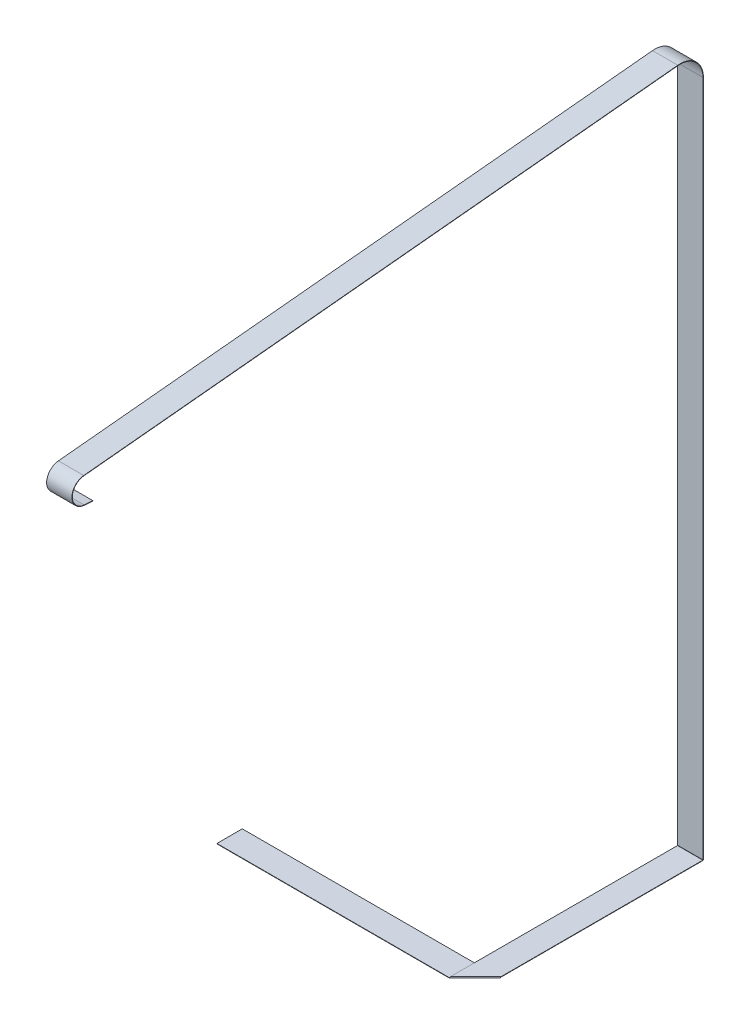
ISO-10303-21;
HEADER;
FILE_DESCRIPTION(('STEP AP214'),'2;1');
FILE_NAME('part.step','',(''),(''),'','','');
FILE_SCHEMA(('AUTOMOTIVE_DESIGN { 1 0 10303 214 1 1 1 1 }'));
ENDSEC;
DATA;
#1=APPLICATION_CONTEXT('core data for automotive mechanical design processes');
#2=APPLICATION_PROTOCOL_DEFINITION('international standard','automotive_design',2000,#1);
#3=PRODUCT_CONTEXT('',#1,'mechanical');
#4=PRODUCT('Part','Part','',(#3));
#5=PRODUCT_RELATED_PRODUCT_CATEGORY('part','',(#4));
#6=PRODUCT_DEFINITION_FORMATION('','',#4);
#7=PRODUCT_DEFINITION_CONTEXT('part definition',#1,'design');
#8=PRODUCT_DEFINITION('design','',#6,#7);
#9=PRODUCT_DEFINITION_SHAPE('','',#8);
#10=(LENGTH_UNIT() NAMED_UNIT(*) SI_UNIT(.MILLI.,.METRE.));
#11=(NAMED_UNIT(*) PLANE_ANGLE_UNIT() SI_UNIT($,.RADIAN.));
#12=(NAMED_UNIT(*) SI_UNIT($,.STERADIAN.) SOLID_ANGLE_UNIT());
#13=UNCERTAINTY_MEASURE_WITH_UNIT(LENGTH_MEASURE(1.E-05),#10,'distance_accuracy_value','');
#14=(GEOMETRIC_REPRESENTATION_CONTEXT(3) GLOBAL_UNCERTAINTY_ASSIGNED_CONTEXT((#13)) GLOBAL_UNIT_ASSIGNED_CONTEXT((#10,
#11,#12)) REPRESENTATION_CONTEXT('',''));
#15=CARTESIAN_POINT('',(0.,0.,0.));
#16=DIRECTION('',(0.,0.,1.));
#17=DIRECTION('',(1.,0.,0.));
#18=AXIS2_PLACEMENT_3D('',#15,#16,#17);
#19=CARTESIAN_POINT('',(146.999999999998,515.612172978623,-867.877093664029));
#20=DIRECTION('',(0.,-0.995227399981831,-0.0975828997591516));
#21=DIRECTION('',(1.,0.,0.));
#22=AXIS2_PLACEMENT_3D('',#19,#20,#21);
#23=PLANE('',#22);
#24=DIRECTION('',(0.,-0.0975828997591516,0.995227399981831));
#25=VECTOR('',#24,1.);
#26=CARTESIAN_POINT('',(146.999999999998,515.612172978623,-867.877093664029));
#27=LINE('',#26,#25);
#28=CARTESIAN_POINT('',(147.,443.070395680476,-128.038816786777));
#29=VERTEX_POINT('',#28);
#30=CARTESIAN_POINT('',(147.000000000001,406.286880735639,247.108489053656));
#31=VERTEX_POINT('',#30);
#32=EDGE_CURVE('E101',#29,#31,#27,.T.);
#33=ORIENTED_EDGE('',*,*,#32,.T.);
#34=DIRECTION('',(1.,0.,0.));
#35=VECTOR('',#34,1.);
#36=CARTESIAN_POINT('',(146.999999999994,406.286880735639,247.108489053657));
#37=LINE('',#36,#35);
#38=CARTESIAN_POINT('',(163.000000000001,406.286880735639,247.108489053657));
#39=VERTEX_POINT('',#38);
#40=EDGE_CURVE('E93',#31,#39,#37,.T.);
#41=ORIENTED_EDGE('',*,*,#40,.T.);
#42=DIRECTION('',(0.,0.0975828997591516,-0.995227399981831));
#43=VECTOR('',#42,1.);
#44=CARTESIAN_POINT('',(162.999999999998,515.612172978623,-867.877093664029));
#45=LINE('',#44,#43);
#46=CARTESIAN_POINT('',(163.,443.070395680476,-128.038816786777));
#47=VERTEX_POINT('',#46);
#48=EDGE_CURVE('E109',#39,#47,#45,.T.);
#49=ORIENTED_EDGE('',*,*,#48,.T.);
#50=DIRECTION('',(1.,0.,0.));
#51=VECTOR('',#50,1.);
#52=CARTESIAN_POINT('',(147.,443.070395680476,-128.038816786777));
#53=LINE('',#52,#51);
#54=EDGE_CURVE('E263',#29,#47,#53,.T.);
#55=ORIENTED_EDGE('',*,*,#54,.F.);
#56=EDGE_LOOP('',(#33,#41,#49,#55));
#57=FACE_BOUND('',#56,.T.);
#58=ADVANCED_FACE('F84',(#57),#23,.F.);
#59=CARTESIAN_POINT('',(147.,-290.626714586765,-144.173285413235));
#60=DIRECTION('',(0.,0.,1.));
#61=DIRECTION('',(1.,0.,0.));
#62=AXIS2_PLACEMENT_3D('',#59,#60,#61);
#63=PLANE('',#62);
#64=DIRECTION('',(0.,1.,0.));
#65=VECTOR('',#64,1.);
#66=CARTESIAN_POINT('',(147.,-290.626714586765,-144.173285413235));
#67=LINE('',#66,#65);
#68=CARTESIAN_POINT('',(147.,0.549999999999301,-144.173285413236));
#69=VERTEX_POINT('',#68);
#70=CARTESIAN_POINT('',(147.,428.440552900743,-144.173285413236));
#71=VERTEX_POINT('',#70);
#72=EDGE_CURVE('E363',#69,#71,#67,.T.);
#73=ORIENTED_EDGE('',*,*,#72,.T.);
#74=DIRECTION('',(1.,0.,0.));
#75=VECTOR('',#74,1.);
#76=CARTESIAN_POINT('',(147.,428.440552900743,-144.173285413236));
#77=LINE('',#76,#75);
#78=CARTESIAN_POINT('',(163.,428.440552900743,-144.173285413236));
#79=VERTEX_POINT('',#78);
#80=EDGE_CURVE('E351',#71,#79,#77,.T.);
#81=ORIENTED_EDGE('',*,*,#80,.T.);
#82=DIRECTION('',(0.,-1.,0.));
#83=VECTOR('',#82,1.);
#84=CARTESIAN_POINT('',(163.,-290.626714586765,-144.173285413235));
#85=LINE('',#84,#83);
#86=CARTESIAN_POINT('',(163.,0.549999999999384,-144.173285413236));
#87=VERTEX_POINT('',#86);
#88=EDGE_CURVE('E373',#79,#87,#85,.T.);
#89=ORIENTED_EDGE('',*,*,#88,.T.);
#90=DIRECTION('',(-1.,0.,0.));
#91=VECTOR('',#90,1.);
#92=CARTESIAN_POINT('',(146.999999999999,0.549999999999301,-144.173285413236));
#93=LINE('',#92,#91);
#94=EDGE_CURVE('E376',#87,#69,#93,.T.);
#95=ORIENTED_EDGE('',*,*,#94,.T.);
#96=EDGE_LOOP('',(#73,#81,#89,#95));
#97=FACE_BOUND('',#96,.T.);
#98=ADVANCED_FACE('F412',(#97),#63,.F.);
#99=CARTESIAN_POINT('',(163.,0.450000000000807,147.));
#100=DIRECTION('',(1.,0.,0.));
#101=DIRECTION('',(0.,0.,1.));
#102=AXIS2_PLACEMENT_3D('',#99,#100,#101);
#103=PLANE('',#102);
#104=DIRECTION('',(0.,0.,1.));
#105=VECTOR('',#104,1.);
#106=CARTESIAN_POINT('',(163.,0.200000000000807,147.));
#107=LINE('',#106,#105);
#108=CARTESIAN_POINT('',(163.,0.199999999999371,-143.823285413236));
#109=VERTEX_POINT('',#108);
#110=CARTESIAN_POINT('',(163.,0.2,-16.4998243305428));
#111=VERTEX_POINT('',#110);
#112=EDGE_CURVE('E634',#109,#111,#107,.T.);
#113=ORIENTED_EDGE('',*,*,#112,.F.);
#114=DIRECTION('',(0.,1.,0.));
#115=VECTOR('',#114,1.);
#116=CARTESIAN_POINT('',(163.,0.449999999999369,-143.823285413236));
#117=LINE('',#116,#115);
#118=CARTESIAN_POINT('',(163.,0.449999999999371,-143.823285413236));
#119=VERTEX_POINT('',#118);
#120=EDGE_CURVE('E1137',#109,#119,#117,.T.);
#121=ORIENTED_EDGE('',*,*,#120,.T.);
#122=DIRECTION('',(0.,0.,1.));
#123=VECTOR('',#122,1.);
#124=CARTESIAN_POINT('',(163.,0.450000000000807,147.));
#125=LINE('',#124,#123);
#126=CARTESIAN_POINT('',(163.,0.45,-16.4998243305428));
#127=VERTEX_POINT('',#126);
#128=EDGE_CURVE('E627',#119,#127,#125,.T.);
#129=ORIENTED_EDGE('',*,*,#128,.T.);
#130=CARTESIAN_POINT('',(163.,0.2,-16.4998243305428));
#131=CARTESIAN_POINT('',(163.,0.45,-16.4998243305428));
#132=B_SPLINE_CURVE_WITH_KNOTS('',1,(#130,#131),.UNSPECIFIED.,.F.,.F.,(2,2),(0.,1.),.UNSPECIFIED.);
#133=EDGE_CURVE('E651',#127,#111,#132,.F.);
#134=ORIENTED_EDGE('',*,*,#133,.T.);
#135=EDGE_LOOP('',(#113,#121,#129,#134));
#136=FACE_BOUND('',#135,.T.);
#137=ADVANCED_FACE('F662',(#136),#103,.T.);
#138=CARTESIAN_POINT('',(147.,0.450000000000728,147.));
#139=DIRECTION('',(-1.,0.,0.));
#140=DIRECTION('',(0.,0.,-1.));
#141=AXIS2_PLACEMENT_3D('',#138,#139,#140);
#142=PLANE('',#141);
#143=DIRECTION('',(0.,0.,-1.));
#144=VECTOR('',#143,1.);
#145=CARTESIAN_POINT('',(147.,0.450000000000728,147.));
#146=LINE('',#145,#144);
#147=CARTESIAN_POINT('',(147.,0.45,-0.499824330542826));
#148=VERTEX_POINT('',#147);
#149=CARTESIAN_POINT('',(147.,0.449999999999292,-143.823285413236));
#150=VERTEX_POINT('',#149);
#151=EDGE_CURVE('E630',#148,#150,#146,.T.);
#152=ORIENTED_EDGE('',*,*,#151,.T.);
#153=DIRECTION('',(0.,-1.,0.));
#154=VECTOR('',#153,1.);
#155=CARTESIAN_POINT('',(147.,0.44999999999929,-143.823285413236));
#156=LINE('',#155,#154);
#157=CARTESIAN_POINT('',(147.,0.199999999999292,-143.823285413236));
#158=VERTEX_POINT('',#157);
#159=EDGE_CURVE('E383',#150,#158,#156,.T.);
#160=ORIENTED_EDGE('',*,*,#159,.T.);
#161=DIRECTION('',(0.,0.,-1.));
#162=VECTOR('',#161,1.);
#163=CARTESIAN_POINT('',(147.,0.200000000000728,147.));
#164=LINE('',#163,#162);
#165=CARTESIAN_POINT('',(147.,0.2,-0.499824330542802));
#166=VERTEX_POINT('',#165);
#167=EDGE_CURVE('E556',#166,#158,#164,.T.);
#168=ORIENTED_EDGE('',*,*,#167,.F.);
#169=CARTESIAN_POINT('',(147.,0.45,-0.499824330542823));
#170=CARTESIAN_POINT('',(147.,0.2,-0.499824330542803));
#171=B_SPLINE_CURVE_WITH_KNOTS('',1,(#169,#170),.UNSPECIFIED.,.F.,.F.,(2,2),(0.,1.),.UNSPECIFIED.);
#172=EDGE_CURVE('E626',#166,#148,#171,.F.);
#173=ORIENTED_EDGE('',*,*,#172,.T.);
#174=EDGE_LOOP('',(#152,#160,#168,#173));
#175=FACE_BOUND('',#174,.T.);
#176=ADVANCED_FACE('F671',(#175),#142,.T.);
#177=CARTESIAN_POINT('',(147.,0.450000000000728,147.));
#178=DIRECTION('',(0.,1.,0.));
#179=DIRECTION('',(1.,0.,0.));
#180=AXIS2_PLACEMENT_3D('',#177,#178,#179);
#181=PLANE('',#180);
#182=ORIENTED_EDGE('',*,*,#128,.F.);
#183=DIRECTION('',(-1.,0.,0.));
#184=VECTOR('',#183,1.);
#185=CARTESIAN_POINT('',(146.999999999999,0.449999999999292,-143.823285413236));
#186=LINE('',#185,#184);
#187=EDGE_CURVE('E1112',#119,#150,#186,.T.);
#188=ORIENTED_EDGE('',*,*,#187,.T.);
#189=ORIENTED_EDGE('',*,*,#151,.F.);
#190=DIRECTION('',(0.707106781186548,0.,-0.707106781186547));
#191=VECTOR('',#190,1.);
#192=CARTESIAN_POINT('',(73.2500878347285,0.45,73.2500878347286));
#193=LINE('',#192,#191);
#194=EDGE_CURVE('E623',#148,#127,#193,.T.);
#195=ORIENTED_EDGE('',*,*,#194,.T.);
#196=EDGE_LOOP('',(#182,#188,#189,#195));
#197=FACE_BOUND('',#196,.T.);
#198=ADVANCED_FACE('F607',(#197),#181,.T.);
#199=CARTESIAN_POINT('',(147.,0.200000000000728,147.));
#200=DIRECTION('',(0.,1.,0.));
#201=DIRECTION('',(1.,0.,0.));
#202=AXIS2_PLACEMENT_3D('',#199,#200,#201);
#203=PLANE('',#202);
#204=DIRECTION('',(-1.,0.,0.));
#205=VECTOR('',#204,1.);
#206=CARTESIAN_POINT('',(146.999999999999,0.199999999999292,-143.823285413236));
#207=LINE('',#206,#205);
#208=EDGE_CURVE('E430',#109,#158,#207,.T.);
#209=ORIENTED_EDGE('',*,*,#208,.F.);
#210=ORIENTED_EDGE('',*,*,#112,.T.);
#211=DIRECTION('',(0.707106781186548,0.,-0.707106781186547));
#212=VECTOR('',#211,1.);
#213=CARTESIAN_POINT('',(73.2500878347285,0.2,73.2500878347286));
#214=LINE('',#213,#212);
#215=EDGE_CURVE('E649',#166,#111,#214,.T.);
#216=ORIENTED_EDGE('',*,*,#215,.F.);
#217=ORIENTED_EDGE('',*,*,#167,.T.);
#218=EDGE_LOOP('',(#209,#210,#216,#217));
#219=FACE_BOUND('',#218,.T.);
#220=ADVANCED_FACE('F672',(#219),#203,.F.);
#221=CARTESIAN_POINT('',(0.,-0.25,0.));
#222=DIRECTION('',(-1.,0.,0.));
#223=DIRECTION('',(0.,0.,1.));
#224=AXIS2_PLACEMENT_3D('',#221,#222,#223);
#225=PLANE('',#224);
#226=DIRECTION('',(0.,0.,1.));
#227=VECTOR('',#226,1.);
#228=CARTESIAN_POINT('',(0.,0.,0.));
#229=LINE('',#228,#227);
#230=CARTESIAN_POINT('',(0.,0.,-16.));
#231=VERTEX_POINT('',#230);
#232=CARTESIAN_POINT('',(0.,0.,0.));
#233=VERTEX_POINT('',#232);
#234=EDGE_CURVE('E558',#231,#233,#229,.T.);
#235=ORIENTED_EDGE('',*,*,#234,.F.);
#236=DIRECTION('',(0.,1.,0.));
#237=VECTOR('',#236,1.);
#238=CARTESIAN_POINT('',(0.,-0.25,-16.));
#239=LINE('',#238,#237);
#240=CARTESIAN_POINT('',(0.,-0.25,-16.));
#241=VERTEX_POINT('',#240);
#242=EDGE_CURVE('E548',#241,#231,#239,.T.);
#243=ORIENTED_EDGE('',*,*,#242,.F.);
#244=DIRECTION('',(0.,0.,1.));
#245=VECTOR('',#244,1.);
#246=CARTESIAN_POINT('',(0.,-0.25,0.));
#247=LINE('',#246,#245);
#248=CARTESIAN_POINT('',(0.,-0.25,0.));
#249=VERTEX_POINT('',#248);
#250=EDGE_CURVE('E565',#241,#249,#247,.T.);
#251=ORIENTED_EDGE('',*,*,#250,.T.);
#252=DIRECTION('',(0.,1.,0.));
#253=VECTOR('',#252,1.);
#254=CARTESIAN_POINT('',(0.,-0.25,0.));
#255=LINE('',#254,#253);
#256=EDGE_CURVE('E562',#249,#233,#255,.T.);
#257=ORIENTED_EDGE('',*,*,#256,.T.);
#258=EDGE_LOOP('',(#235,#243,#251,#257));
#259=FACE_BOUND('',#258,.T.);
#260=ADVANCED_FACE('F518',(#259),#225,.T.);
#261=CARTESIAN_POINT('',(0.,-0.25,0.));
#262=DIRECTION('',(0.,-1.,0.));
#263=DIRECTION('',(0.,0.,-1.));
#264=AXIS2_PLACEMENT_3D('',#261,#262,#263);
#265=PLANE('',#264);
#266=DIRECTION('',(0.707106781186548,0.,-0.707106781186547));
#267=VECTOR('',#266,1.);
#268=CARTESIAN_POINT('',(73.2500878347285,-0.25,73.2500878347286));
#269=LINE('',#268,#267);
#270=CARTESIAN_POINT('',(146.500175669457,-0.25,0.));
#271=VERTEX_POINT('',#270);
#272=CARTESIAN_POINT('',(162.500175669457,-0.25,-16.));
#273=VERTEX_POINT('',#272);
#274=EDGE_CURVE('E573',#271,#273,#269,.T.);
#275=ORIENTED_EDGE('',*,*,#274,.F.);
#276=DIRECTION('',(1.,0.,0.));
#277=VECTOR('',#276,1.);
#278=CARTESIAN_POINT('',(0.,-0.25,0.));
#279=LINE('',#278,#277);
#280=EDGE_CURVE('E564',#249,#271,#279,.T.);
#281=ORIENTED_EDGE('',*,*,#280,.F.);
#282=ORIENTED_EDGE('',*,*,#250,.F.);
#283=DIRECTION('',(-1.,0.,0.));
#284=VECTOR('',#283,1.);
#285=CARTESIAN_POINT('',(0.,-0.25,-16.));
#286=LINE('',#285,#284);
#287=EDGE_CURVE('E557',#273,#241,#286,.T.);
#288=ORIENTED_EDGE('',*,*,#287,.F.);
#289=EDGE_LOOP('',(#275,#281,#282,#288));
#290=FACE_BOUND('',#289,.T.);
#291=ADVANCED_FACE('F598',(#290),#265,.T.);
#292=CARTESIAN_POINT('',(0.,-0.25,0.));
#293=DIRECTION('',(0.,0.,1.));
#294=DIRECTION('',(1.,0.,0.));
#295=AXIS2_PLACEMENT_3D('',#292,#293,#294);
#296=PLANE('',#295);
#297=CARTESIAN_POINT('',(146.500175669457,0.,0.));
#298=CARTESIAN_POINT('',(146.500175669457,-0.25,0.));
#299=B_SPLINE_CURVE_WITH_KNOTS('',1,(#297,#298),.UNSPECIFIED.,.F.,.F.,(2,2),(0.,1.),.UNSPECIFIED.);
#300=CARTESIAN_POINT('',(146.500175669457,0.,0.));
#301=VERTEX_POINT('',#300);
#302=EDGE_CURVE('E568',#301,#271,#299,.T.);
#303=ORIENTED_EDGE('',*,*,#302,.F.);
#304=DIRECTION('',(1.,0.,0.));
#305=VECTOR('',#304,1.);
#306=CARTESIAN_POINT('',(0.,0.,0.));
#307=LINE('',#306,#305);
#308=EDGE_CURVE('E570',#233,#301,#307,.T.);
#309=ORIENTED_EDGE('',*,*,#308,.F.);
#310=ORIENTED_EDGE('',*,*,#256,.F.);
#311=ORIENTED_EDGE('',*,*,#280,.T.);
#312=EDGE_LOOP('',(#303,#309,#310,#311));
#313=FACE_BOUND('',#312,.T.);
#314=ADVANCED_FACE('F588',(#313),#296,.T.);
#315=CARTESIAN_POINT('',(0.,0.,0.));
#316=DIRECTION('',(0.,-1.,0.));
#317=DIRECTION('',(0.,0.,-1.));
#318=AXIS2_PLACEMENT_3D('',#315,#316,#317);
#319=PLANE('',#318);
#320=ORIENTED_EDGE('',*,*,#308,.T.);
#321=DIRECTION('',(0.707106781186548,0.,-0.707106781186547));
#322=VECTOR('',#321,1.);
#323=CARTESIAN_POINT('',(73.2500878347285,0.,73.2500878347286));
#324=LINE('',#323,#322);
#325=CARTESIAN_POINT('',(162.500175669457,0.,-16.));
#326=VERTEX_POINT('',#325);
#327=EDGE_CURVE('E586',#301,#326,#324,.T.);
#328=ORIENTED_EDGE('',*,*,#327,.T.);
#329=DIRECTION('',(-1.,0.,0.));
#330=VECTOR('',#329,1.);
#331=CARTESIAN_POINT('',(0.,0.,-16.));
#332=LINE('',#331,#330);
#333=EDGE_CURVE('E561',#326,#231,#332,.T.);
#334=ORIENTED_EDGE('',*,*,#333,.T.);
#335=ORIENTED_EDGE('',*,*,#234,.T.);
#336=EDGE_LOOP('',(#320,#328,#334,#335));
#337=FACE_BOUND('',#336,.T.);
#338=ADVANCED_FACE('F597',(#337),#319,.F.);
#339=CARTESIAN_POINT('',(0.,-0.25,-16.));
#340=DIRECTION('',(0.,0.,-1.));
#341=DIRECTION('',(-1.,0.,0.));
#342=AXIS2_PLACEMENT_3D('',#339,#340,#341);
#343=PLANE('',#342);
#344=CARTESIAN_POINT('',(162.500175669457,-0.25,-16.));
#345=CARTESIAN_POINT('',(162.500175669457,0.,-16.));
#346=B_SPLINE_CURVE_WITH_KNOTS('',1,(#344,#345),.UNSPECIFIED.,.F.,.F.,(2,2),(0.,1.),.UNSPECIFIED.);
#347=EDGE_CURVE('E544',#273,#326,#346,.T.);
#348=ORIENTED_EDGE('',*,*,#347,.F.);
#349=ORIENTED_EDGE('',*,*,#287,.T.);
#350=ORIENTED_EDGE('',*,*,#242,.T.);
#351=ORIENTED_EDGE('',*,*,#333,.F.);
#352=EDGE_LOOP('',(#348,#349,#350,#351));
#353=FACE_BOUND('',#352,.T.);
#354=ADVANCED_FACE('F601',(#353),#343,.T.);
#355=CARTESIAN_POINT('',(147.,0.45,-0.499824330542823));
#356=CARTESIAN_POINT('',(147.023186004056,0.450000000000011,-0.393168711884173));
#357=CARTESIAN_POINT('',(147.045881052045,0.412279416263452,-0.287335168317198));
#358=CARTESIAN_POINT('',(147.054206782684,0.282695330567171,-0.112401327497013));
#359=CARTESIAN_POINT('',(147.039227235689,0.191629785729722,-0.0440768194013309));
#360=CARTESIAN_POINT('',(146.955923180599,0.00837021427030879,0.0392272356891446));
#361=CARTESIAN_POINT('',(146.887598672503,-0.0826953305671436,0.0542067826839406));
#362=CARTESIAN_POINT('',(146.712664831683,-0.212279416263436,0.0458810520447048));
#363=CARTESIAN_POINT('',(146.606831288116,-0.250000000000003,0.0231860040562505));
#364=CARTESIAN_POINT('',(146.500175669457,-0.25,0.));
#365=CARTESIAN_POINT('',(147.,0.2,-0.499824330542803));
#366=CARTESIAN_POINT('',(146.976849263986,0.200000000000004,-0.439632416907016));
#367=CARTESIAN_POINT('',(146.95360597552,0.189222690360983,-0.379610244842286));
#368=CARTESIAN_POINT('',(146.896481859209,0.152198665876332,-0.2701262509719));
#369=CARTESIAN_POINT('',(146.862450540392,0.126179938779918,-0.220853514697966));
#370=CARTESIAN_POINT('',(146.779146485302,0.0738200612200903,-0.137549459607494));
#371=CARTESIAN_POINT('',(146.729873749028,0.0478013341236705,-0.103518140790956));
#372=CARTESIAN_POINT('',(146.620389755158,0.0107773096390154,-0.046394024480404));
#373=CARTESIAN_POINT('',(146.560367583093,0.,-0.0231507360137306));
#374=CARTESIAN_POINT('',(146.500175669457,0.,0.));
#375=B_SPLINE_SURFACE_WITH_KNOTS('',1,3,((#355,#356,#357,#358,#359,#360,#361,#362,#363,#364),
(#365,#366,#367,#368,#369,#370,#371,#372,#373,#374)),.UNSPECIFIED.,.F.,.F.,.F.,(2,2),(4,2,2,2,
4),(0.,1.),(0.,0.25,0.5,0.75,1.),.UNSPECIFIED.);
#376=CARTESIAN_POINT('',(147.,0.2,-0.499824330542803));
#377=CARTESIAN_POINT('',(146.976849263986,0.200000000000004,-0.439632416907016));
#378=CARTESIAN_POINT('',(146.95360597552,0.189222690360983,-0.379610244842286));
#379=CARTESIAN_POINT('',(146.896481859209,0.152198665876332,-0.2701262509719));
#380=CARTESIAN_POINT('',(146.862450540392,0.126179938779918,-0.220853514697966));
#381=CARTESIAN_POINT('',(146.779146485302,0.0738200612200903,-0.137549459607494));
#382=CARTESIAN_POINT('',(146.729873749028,0.0478013341236705,-0.103518140790956));
#383=CARTESIAN_POINT('',(146.620389755158,0.0107773096390154,-0.046394024480404));
#384=CARTESIAN_POINT('',(146.560367583093,0.,-0.0231507360137306));
#385=CARTESIAN_POINT('',(146.500175669457,0.,0.));
#386=B_SPLINE_CURVE_WITH_KNOTS('',3,(#376,#377,#378,#379,#380,#381,#382,#383,#384,#385),
.UNSPECIFIED.,.F.,.F.,(4,2,2,2,4),(0.,0.25,0.5,0.75,1.),.UNSPECIFIED.);
#387=EDGE_CURVE('E1096',#166,#301,#386,.T.);
#388=CARTESIAN_POINT('',(146.500175669457,-0.25,0.));
#389=CARTESIAN_POINT('',(146.606831288116,-0.250000000000003,0.0231860040562505));
#390=CARTESIAN_POINT('',(146.712664831683,-0.212279416263436,0.0458810520447048));
#391=CARTESIAN_POINT('',(146.887598672503,-0.0826953305671436,0.0542067826839406));
#392=CARTESIAN_POINT('',(146.955923180599,0.00837021427030879,0.0392272356891446));
#393=CARTESIAN_POINT('',(147.039227235689,0.191629785729722,-0.0440768194013309));
#394=CARTESIAN_POINT('',(147.054206782684,0.282695330567171,-0.112401327497013));
#395=CARTESIAN_POINT('',(147.045881052045,0.412279416263452,-0.287335168317198));
#396=CARTESIAN_POINT('',(147.023186004056,0.450000000000011,-0.393168711884173));
#397=CARTESIAN_POINT('',(147.,0.45,-0.499824330542823));
#398=B_SPLINE_CURVE_WITH_KNOTS('',3,(#388,#389,#390,#391,#392,#393,#394,#395,#396,#397),
.UNSPECIFIED.,.F.,.F.,(4,2,2,2,4),(0.,0.25,0.5,0.75,1.),.UNSPECIFIED.);
#399=EDGE_CURVE('E1099',#148,#271,#398,.F.);
#400=ORIENTED_EDGE('',*,*,#172,.F.);
#401=ORIENTED_EDGE('',*,*,#387,.T.);
#402=ORIENTED_EDGE('',*,*,#302,.T.);
#403=ORIENTED_EDGE('',*,*,#399,.F.);
#404=EDGE_LOOP('',(#400,#401,#402,#403));
#405=FACE_BOUND('',#404,.T.);
#406=ADVANCED_FACE('F514',(#405),#375,.T.);
#407=CARTESIAN_POINT('',(162.500175669457,-0.25,-16.));
#408=CARTESIAN_POINT('',(162.606831288116,-0.250000000000009,-15.9768139959438));
#409=CARTESIAN_POINT('',(162.712664831683,-0.212279416263448,-15.9541189479553));
#410=CARTESIAN_POINT('',(162.887598672503,-0.0826953305671604,-15.9457932173161));
#411=CARTESIAN_POINT('',(162.955923180599,0.00837021427029187,-15.9607727643109));
#412=CARTESIAN_POINT('',(163.039227235689,0.191629785729708,-16.0440768194013));
#413=CARTESIAN_POINT('',(163.054206782684,0.282695330567161,-16.112401327497));
#414=CARTESIAN_POINT('',(163.045881052045,0.412279416263448,-16.2873351683172));
#415=CARTESIAN_POINT('',(163.023186004056,0.450000000000009,-16.3931687118842));
#416=CARTESIAN_POINT('',(163.,0.45,-16.4998243305428));
#417=CARTESIAN_POINT('',(162.500175669457,0.,-16.));
#418=CARTESIAN_POINT('',(162.560367583093,0.,-16.0231507360137));
#419=CARTESIAN_POINT('',(162.620389755158,0.0107773096390146,-16.0463940244804));
#420=CARTESIAN_POINT('',(162.729873749028,0.0478013341236679,-16.103518140791));
#421=CARTESIAN_POINT('',(162.779146485302,0.0738200612200847,-16.1375494596075));
#422=CARTESIAN_POINT('',(162.862450540392,0.126179938779915,-16.220853514698));
#423=CARTESIAN_POINT('',(162.896481859209,0.152198665876328,-16.2701262509719));
#424=CARTESIAN_POINT('',(162.95360597552,0.189222690360982,-16.3796102448423));
#425=CARTESIAN_POINT('',(162.976849263986,0.200000000000003,-16.439632416907));
#426=CARTESIAN_POINT('',(163.,0.2,-16.4998243305428));
#427=B_SPLINE_SURFACE_WITH_KNOTS('',1,3,((#407,#408,#409,#410,#411,#412,#413,#414,#415,#416),
(#417,#418,#419,#420,#421,#422,#423,#424,#425,#426)),.UNSPECIFIED.,.F.,.F.,.F.,(2,2),(4,2,2,2,
4),(0.,1.),(0.,0.25,0.5,0.75,1.),.UNSPECIFIED.);
#428=CARTESIAN_POINT('',(162.500175669457,0.,-16.));
#429=CARTESIAN_POINT('',(162.560367583093,0.,-16.0231507360137));
#430=CARTESIAN_POINT('',(162.620389755158,0.0107773096390146,-16.0463940244804));
#431=CARTESIAN_POINT('',(162.729873749028,0.0478013341236679,-16.103518140791));
#432=CARTESIAN_POINT('',(162.779146485302,0.0738200612200847,-16.1375494596075));
#433=CARTESIAN_POINT('',(162.862450540392,0.126179938779915,-16.220853514698));
#434=CARTESIAN_POINT('',(162.896481859209,0.152198665876328,-16.2701262509719));
#435=CARTESIAN_POINT('',(162.95360597552,0.189222690360982,-16.3796102448423));
#436=CARTESIAN_POINT('',(162.976849263986,0.200000000000003,-16.439632416907));
#437=CARTESIAN_POINT('',(163.,0.2,-16.4998243305428));
#438=B_SPLINE_CURVE_WITH_KNOTS('',3,(#428,#429,#430,#431,#432,#433,#434,#435,#436,#437),
.UNSPECIFIED.,.F.,.F.,(4,2,2,2,4),(0.,0.25,0.5,0.75,1.),.UNSPECIFIED.);
#439=EDGE_CURVE('E487',#326,#111,#438,.T.);
#440=CARTESIAN_POINT('',(163.,0.45,-16.4998243305428));
#441=CARTESIAN_POINT('',(163.023186004056,0.450000000000009,-16.3931687118842));
#442=CARTESIAN_POINT('',(163.045881052045,0.412279416263448,-16.2873351683172));
#443=CARTESIAN_POINT('',(163.054206782684,0.282695330567161,-16.112401327497));
#444=CARTESIAN_POINT('',(163.039227235689,0.191629785729708,-16.0440768194013));
#445=CARTESIAN_POINT('',(162.955923180599,0.00837021427029187,-15.9607727643109));
#446=CARTESIAN_POINT('',(162.887598672503,-0.0826953305671604,-15.9457932173161));
#447=CARTESIAN_POINT('',(162.712664831683,-0.212279416263448,-15.9541189479553));
#448=CARTESIAN_POINT('',(162.606831288116,-0.250000000000009,-15.9768139959438));
#449=CARTESIAN_POINT('',(162.500175669457,-0.25,-16.));
#450=B_SPLINE_CURVE_WITH_KNOTS('',3,(#440,#441,#442,#443,#444,#445,#446,#447,#448,#449),
.UNSPECIFIED.,.F.,.F.,(4,2,2,2,4),(0.,0.25,0.5,0.75,1.),.UNSPECIFIED.);
#451=EDGE_CURVE('E479',#273,#127,#450,.F.);
#452=ORIENTED_EDGE('',*,*,#439,.T.);
#453=ORIENTED_EDGE('',*,*,#133,.F.);
#454=ORIENTED_EDGE('',*,*,#451,.F.);
#455=ORIENTED_EDGE('',*,*,#347,.T.);
#456=EDGE_LOOP('',(#452,#453,#454,#455));
#457=FACE_BOUND('',#456,.T.);
#458=ADVANCED_FACE('F456',(#457),#427,.T.);
#459=CARTESIAN_POINT('',(171.008515298268,0.1,-24.5083396288111));
#460=DIRECTION('',(-0.707106781186548,0.,0.707106781186547));
#461=DIRECTION('',(0.707106781186547,0.,0.707106781186548));
#462=AXIS2_PLACEMENT_3D('',#459,#460,#461);
#463=CYLINDRICAL_SURFACE('',#462,0.35);
#464=ORIENTED_EDGE('',*,*,#274,.T.);
#465=ORIENTED_EDGE('',*,*,#451,.T.);
#466=ORIENTED_EDGE('',*,*,#194,.F.);
#467=ORIENTED_EDGE('',*,*,#399,.T.);
#468=EDGE_LOOP('',(#464,#465,#466,#467));
#469=FACE_BOUND('',#468,.T.);
#470=ADVANCED_FACE('F445',(#469),#463,.T.);
#471=CARTESIAN_POINT('',(171.008515298268,0.1,-24.5083396288111));
#472=DIRECTION('',(-0.707106781186548,0.,0.707106781186547));
#473=DIRECTION('',(0.707106781186547,0.,0.707106781186548));
#474=AXIS2_PLACEMENT_3D('',#471,#472,#473);
#475=CYLINDRICAL_SURFACE('',#474,0.1);
#476=ORIENTED_EDGE('',*,*,#327,.F.);
#477=ORIENTED_EDGE('',*,*,#387,.F.);
#478=ORIENTED_EDGE('',*,*,#215,.T.);
#479=ORIENTED_EDGE('',*,*,#439,.F.);
#480=EDGE_LOOP('',(#476,#477,#478,#479));
#481=FACE_BOUND('',#480,.T.);
#482=ADVANCED_FACE('F455',(#481),#475,.F.);
#483=CARTESIAN_POINT('',(163.,0.549999999999371,-143.823285413236));
#484=DIRECTION('',(-1.,0.,0.));
#485=DIRECTION('',(0.,0.,1.));
#486=AXIS2_PLACEMENT_3D('',#483,#484,#485);
#487=PLANE('',#486);
#488=ORIENTED_EDGE('',*,*,#120,.F.);
#489=CARTESIAN_POINT('',(163.,0.549999999999371,-143.823285413236));
#490=DIRECTION('',(-1.,0.,0.));
#491=DIRECTION('',(0.,-1.,0.));
#492=AXIS2_PLACEMENT_3D('',#489,#490,#491);
#493=CIRCLE('',#492,0.35);
#494=EDGE_CURVE('E362',#109,#87,#493,.F.);
#495=ORIENTED_EDGE('',*,*,#494,.T.);
#496=DIRECTION('',(0.,0.,1.));
#497=VECTOR('',#496,1.);
#498=CARTESIAN_POINT('',(163.,0.549999999999384,-143.923285413236));
#499=LINE('',#498,#497);
#500=CARTESIAN_POINT('',(163.,0.549999999999384,-143.923285413236));
#501=VERTEX_POINT('',#500);
#502=EDGE_CURVE('E409',#87,#501,#499,.T.);
#503=ORIENTED_EDGE('',*,*,#502,.T.);
#504=CARTESIAN_POINT('',(163.,0.549999999999371,-143.823285413236));
#505=DIRECTION('',(1.,0.,0.));
#506=DIRECTION('',(0.,0.,1.));
#507=AXIS2_PLACEMENT_3D('',#504,#505,#506);
#508=CIRCLE('',#507,0.0999999999999946);
#509=EDGE_CURVE('E432',#119,#501,#508,.T.);
#510=ORIENTED_EDGE('',*,*,#509,.F.);
#511=EDGE_LOOP('',(#488,#495,#503,#510));
#512=FACE_BOUND('',#511,.T.);
#513=ADVANCED_FACE('F773',(#512),#487,.F.);
#514=CARTESIAN_POINT('',(147.,0.549999999999292,-143.823285413236));
#515=DIRECTION('',(1.,0.,0.));
#516=DIRECTION('',(0.,0.,-1.));
#517=AXIS2_PLACEMENT_3D('',#514,#515,#516);
#518=PLANE('',#517);
#519=CARTESIAN_POINT('',(147.,0.549999999999292,-143.823285413236));
#520=DIRECTION('',(-1.,0.,0.));
#521=DIRECTION('',(0.,-1.,0.));
#522=AXIS2_PLACEMENT_3D('',#519,#520,#521);
#523=CIRCLE('',#522,0.35);
#524=EDGE_CURVE('E422',#69,#158,#523,.T.);
#525=ORIENTED_EDGE('',*,*,#524,.T.);
#526=ORIENTED_EDGE('',*,*,#159,.F.);
#527=CARTESIAN_POINT('',(147.,0.549999999999292,-143.823285413236));
#528=DIRECTION('',(-1.,0.,0.));
#529=DIRECTION('',(0.,0.,-1.));
#530=AXIS2_PLACEMENT_3D('',#527,#528,#529);
#531=CIRCLE('',#530,0.0999999999999945);
#532=CARTESIAN_POINT('',(147.,0.549999999999302,-143.923285413236));
#533=VERTEX_POINT('',#532);
#534=EDGE_CURVE('E425',#533,#150,#531,.T.);
#535=ORIENTED_EDGE('',*,*,#534,.F.);
#536=DIRECTION('',(0.,0.,-1.));
#537=VECTOR('',#536,1.);
#538=CARTESIAN_POINT('',(147.,0.549999999999301,-143.923285413236));
#539=LINE('',#538,#537);
#540=EDGE_CURVE('E420',#533,#69,#539,.T.);
#541=ORIENTED_EDGE('',*,*,#540,.T.);
#542=EDGE_LOOP('',(#525,#526,#535,#541));
#543=FACE_BOUND('',#542,.T.);
#544=ADVANCED_FACE('F421',(#543),#518,.F.);
#545=CARTESIAN_POINT('',(171.00585555916,0.549999999999411,-143.823285413236));
#546=DIRECTION('',(-1.,0.,0.));
#547=DIRECTION('',(0.,-1.,0.));
#548=AXIS2_PLACEMENT_3D('',#545,#546,#547);
#549=CYLINDRICAL_SURFACE('',#548,0.1);
#550=DIRECTION('',(-1.,0.,0.));
#551=VECTOR('',#550,1.);
#552=CARTESIAN_POINT('',(146.999999999999,0.549999999999301,-143.923285413236));
#553=LINE('',#552,#551);
#554=EDGE_CURVE('E394',#501,#533,#553,.T.);
#555=ORIENTED_EDGE('',*,*,#554,.T.);
#556=ORIENTED_EDGE('',*,*,#534,.T.);
#557=ORIENTED_EDGE('',*,*,#187,.F.);
#558=ORIENTED_EDGE('',*,*,#509,.T.);
#559=EDGE_LOOP('',(#555,#556,#557,#558));
#560=FACE_BOUND('',#559,.T.);
#561=ADVANCED_FACE('F784',(#560),#549,.F.);
#562=CARTESIAN_POINT('',(171.00585555916,0.549999999999411,-143.823285413236));
#563=DIRECTION('',(-1.,0.,0.));
#564=DIRECTION('',(0.,-1.,0.));
#565=AXIS2_PLACEMENT_3D('',#562,#563,#564);
#566=CYLINDRICAL_SURFACE('',#565,0.35);
#567=ORIENTED_EDGE('',*,*,#94,.F.);
#568=ORIENTED_EDGE('',*,*,#494,.F.);
#569=ORIENTED_EDGE('',*,*,#208,.T.);
#570=ORIENTED_EDGE('',*,*,#524,.F.);
#571=EDGE_LOOP('',(#567,#568,#569,#570));
#572=FACE_BOUND('',#571,.T.);
#573=ADVANCED_FACE('F428',(#572),#566,.T.);
#574=CARTESIAN_POINT('',(147.,-290.626714586765,-143.923285413235));
#575=DIRECTION('',(0.,0.,1.));
#576=DIRECTION('',(1.,0.,0.));
#577=AXIS2_PLACEMENT_3D('',#574,#575,#576);
#578=PLANE('',#577);
#579=DIRECTION('',(1.,0.,0.));
#580=VECTOR('',#579,1.);
#581=CARTESIAN_POINT('',(147.,428.440552900743,-143.923285413236));
#582=LINE('',#581,#580);
#583=CARTESIAN_POINT('',(147.,428.440552900743,-143.923285413236));
#584=VERTEX_POINT('',#583);
#585=CARTESIAN_POINT('',(163.,428.440552900743,-143.923285413236));
#586=VERTEX_POINT('',#585);
#587=EDGE_CURVE('E379',#584,#586,#582,.T.);
#588=ORIENTED_EDGE('',*,*,#587,.F.);
#589=DIRECTION('',(0.,1.,0.));
#590=VECTOR('',#589,1.);
#591=CARTESIAN_POINT('',(147.,-290.626714586765,-143.923285413235));
#592=LINE('',#591,#590);
#593=EDGE_CURVE('E359',#533,#584,#592,.T.);
#594=ORIENTED_EDGE('',*,*,#593,.F.);
#595=ORIENTED_EDGE('',*,*,#554,.F.);
#596=DIRECTION('',(0.,-1.,0.));
#597=VECTOR('',#596,1.);
#598=CARTESIAN_POINT('',(163.,-290.626714586765,-143.923285413235));
#599=LINE('',#598,#597);
#600=EDGE_CURVE('E377',#586,#501,#599,.T.);
#601=ORIENTED_EDGE('',*,*,#600,.F.);
#602=EDGE_LOOP('',(#588,#594,#595,#601));
#603=FACE_BOUND('',#602,.T.);
#604=ADVANCED_FACE('F679',(#603),#578,.T.);
#605=CARTESIAN_POINT('',(163.,-290.626714586765,-143.923285413235));
#606=DIRECTION('',(1.,0.,0.));
#607=DIRECTION('',(0.,-1.,0.));
#608=AXIS2_PLACEMENT_3D('',#605,#606,#607);
#609=PLANE('',#608);
#610=DIRECTION('',(0.,0.,-1.));
#611=VECTOR('',#610,1.);
#612=CARTESIAN_POINT('',(163.,428.440552900743,-143.923285413235));
#613=LINE('',#612,#611);
#614=EDGE_CURVE('E382',#586,#79,#613,.T.);
#615=ORIENTED_EDGE('',*,*,#614,.F.);
#616=ORIENTED_EDGE('',*,*,#600,.T.);
#617=ORIENTED_EDGE('',*,*,#502,.F.);
#618=ORIENTED_EDGE('',*,*,#88,.F.);
#619=EDGE_LOOP('',(#615,#616,#617,#618));
#620=FACE_BOUND('',#619,.T.);
#621=ADVANCED_FACE('F405',(#620),#609,.T.);
#622=CARTESIAN_POINT('',(147.,-290.626714586765,-143.923285413235));
#623=DIRECTION('',(-1.,0.,0.));
#624=DIRECTION('',(0.,1.,0.));
#625=AXIS2_PLACEMENT_3D('',#622,#623,#624);
#626=PLANE('',#625);
#627=DIRECTION('',(0.,0.,1.));
#628=VECTOR('',#627,1.);
#629=CARTESIAN_POINT('',(147.,428.440552900743,-143.923285413235));
#630=LINE('',#629,#628);
#631=EDGE_CURVE('E288',#71,#584,#630,.T.);
#632=ORIENTED_EDGE('',*,*,#631,.F.);
#633=ORIENTED_EDGE('',*,*,#72,.F.);
#634=ORIENTED_EDGE('',*,*,#540,.F.);
#635=ORIENTED_EDGE('',*,*,#593,.T.);
#636=EDGE_LOOP('',(#632,#633,#634,#635));
#637=FACE_BOUND('',#636,.T.);
#638=ADVANCED_FACE('F685',(#637),#626,.T.);
#639=CARTESIAN_POINT('',(147.,428.440552900743,-129.473285413236));
#640=DIRECTION('',(1.,0.,0.));
#641=DIRECTION('',(0.,0.,-1.));
#642=AXIS2_PLACEMENT_3D('',#639,#640,#641);
#643=PLANE('',#642);
#644=DIRECTION('',(0.,-0.995227399981831,-0.0975828997591531));
#645=VECTOR('',#644,1.);
#646=CARTESIAN_POINT('',(147.,442.821588830479,-128.063212511717));
#647=LINE('',#646,#645);
#648=CARTESIAN_POINT('',(147.,442.82158883048,-128.063212511716));
#649=VERTEX_POINT('',#648);
#650=EDGE_CURVE('E272',#29,#649,#647,.T.);
#651=ORIENTED_EDGE('',*,*,#650,.F.);
#652=CARTESIAN_POINT('',(147.,428.440552900743,-129.473285413236));
#653=DIRECTION('',(-1.,0.,0.));
#654=DIRECTION('',(0.,0.,1.));
#655=AXIS2_PLACEMENT_3D('',#652,#653,#654);
#656=CIRCLE('',#655,14.7);
#657=EDGE_CURVE('E271',#29,#71,#656,.T.);
#658=ORIENTED_EDGE('',*,*,#657,.T.);
#659=ORIENTED_EDGE('',*,*,#631,.T.);
#660=CARTESIAN_POINT('',(147.,428.440552900743,-129.473285413236));
#661=DIRECTION('',(-1.,0.,0.));
#662=DIRECTION('',(0.,0.,-1.));
#663=AXIS2_PLACEMENT_3D('',#660,#661,#662);
#664=CIRCLE('',#663,14.45);
#665=EDGE_CURVE('E343',#649,#584,#664,.T.);
#666=ORIENTED_EDGE('',*,*,#665,.F.);
#667=EDGE_LOOP('',(#651,#658,#659,#666));
#668=FACE_BOUND('',#667,.T.);
#669=ADVANCED_FACE('F340',(#668),#643,.F.);
#670=CARTESIAN_POINT('',(163.,428.440552900743,-129.473285413236));
#671=DIRECTION('',(-1.,0.,0.));
#672=DIRECTION('',(0.,0.,1.));
#673=AXIS2_PLACEMENT_3D('',#670,#671,#672);
#674=PLANE('',#673);
#675=CARTESIAN_POINT('',(163.,428.440552900743,-129.473285413236));
#676=DIRECTION('',(-1.,0.,0.));
#677=DIRECTION('',(0.,0.,1.));
#678=AXIS2_PLACEMENT_3D('',#675,#676,#677);
#679=CIRCLE('',#678,14.7);
#680=EDGE_CURVE('E352',#79,#47,#679,.F.);
#681=ORIENTED_EDGE('',*,*,#680,.T.);
#682=DIRECTION('',(0.,0.995227399981831,0.0975828997591531));
#683=VECTOR('',#682,1.);
#684=CARTESIAN_POINT('',(163.,442.821588830479,-128.063212511717));
#685=LINE('',#684,#683);
#686=CARTESIAN_POINT('',(163.,442.82158883048,-128.063212511717));
#687=VERTEX_POINT('',#686);
#688=EDGE_CURVE('E398',#687,#47,#685,.T.);
#689=ORIENTED_EDGE('',*,*,#688,.F.);
#690=CARTESIAN_POINT('',(163.,428.440552900743,-129.473285413236));
#691=DIRECTION('',(1.,0.,0.));
#692=DIRECTION('',(0.,0.,1.));
#693=AXIS2_PLACEMENT_3D('',#690,#691,#692);
#694=CIRCLE('',#693,14.45);
#695=EDGE_CURVE('E356',#586,#687,#694,.T.);
#696=ORIENTED_EDGE('',*,*,#695,.F.);
#697=ORIENTED_EDGE('',*,*,#614,.T.);
#698=EDGE_LOOP('',(#681,#689,#696,#697));
#699=FACE_BOUND('',#698,.T.);
#700=ADVANCED_FACE('F402',(#699),#674,.F.);
#701=CARTESIAN_POINT('',(184.111357148688,428.440552900743,-129.473285413236));
#702=DIRECTION('',(-1.,0.,0.));
#703=DIRECTION('',(0.,0.,1.));
#704=AXIS2_PLACEMENT_3D('',#701,#702,#703);
#705=CYLINDRICAL_SURFACE('',#704,14.45);
#706=ORIENTED_EDGE('',*,*,#587,.T.);
#707=ORIENTED_EDGE('',*,*,#695,.T.);
#708=DIRECTION('',(1.,0.,0.));
#709=VECTOR('',#708,1.);
#710=CARTESIAN_POINT('',(147.,442.82158883048,-128.063212511716));
#711=LINE('',#710,#709);
#712=EDGE_CURVE('E393',#649,#687,#711,.T.);
#713=ORIENTED_EDGE('',*,*,#712,.F.);
#714=ORIENTED_EDGE('',*,*,#665,.T.);
#715=EDGE_LOOP('',(#706,#707,#713,#714));
#716=FACE_BOUND('',#715,.T.);
#717=ADVANCED_FACE('F389',(#716),#705,.F.);
#718=CARTESIAN_POINT('',(184.111357148688,428.440552900743,-129.473285413236));
#719=DIRECTION('',(-1.,0.,0.));
#720=DIRECTION('',(0.,0.,1.));
#721=AXIS2_PLACEMENT_3D('',#718,#719,#720);
#722=CYLINDRICAL_SURFACE('',#721,14.7);
#723=ORIENTED_EDGE('',*,*,#80,.F.);
#724=ORIENTED_EDGE('',*,*,#657,.F.);
#725=ORIENTED_EDGE('',*,*,#54,.T.);
#726=ORIENTED_EDGE('',*,*,#680,.F.);
#727=EDGE_LOOP('',(#723,#724,#725,#726));
#728=FACE_BOUND('',#727,.T.);
#729=ADVANCED_FACE('F347',(#728),#722,.T.);
#730=CARTESIAN_POINT('',(146.999999999998,515.363366128627,-867.901489388968));
#731=DIRECTION('',(0.,-0.995227399981831,-0.0975828997591516));
#732=DIRECTION('',(1.,0.,0.));
#733=AXIS2_PLACEMENT_3D('',#730,#731,#732);
#734=PLANE('',#733);
#735=DIRECTION('',(1.,0.,0.));
#736=VECTOR('',#735,1.);
#737=CARTESIAN_POINT('',(146.999999999994,406.038073885643,247.084093328717));
#738=LINE('',#737,#736);
#739=CARTESIAN_POINT('',(147.000000000001,406.038073885643,247.084093328716));
#740=VERTEX_POINT('',#739);
#741=CARTESIAN_POINT('',(163.000000000001,406.038073885643,247.084093328716));
#742=VERTEX_POINT('',#741);
#743=EDGE_CURVE('E284',#740,#742,#738,.T.);
#744=ORIENTED_EDGE('',*,*,#743,.F.);
#745=DIRECTION('',(0.,-0.0975828997591516,0.995227399981831));
#746=VECTOR('',#745,1.);
#747=CARTESIAN_POINT('',(146.999999999998,515.363366128627,-867.901489388968));
#748=LINE('',#747,#746);
#749=EDGE_CURVE('E268',#649,#740,#748,.T.);
#750=ORIENTED_EDGE('',*,*,#749,.F.);
#751=ORIENTED_EDGE('',*,*,#712,.T.);
#752=DIRECTION('',(0.,0.0975828997591516,-0.995227399981831));
#753=VECTOR('',#752,1.);
#754=CARTESIAN_POINT('',(162.999999999998,515.363366128627,-867.901489388968));
#755=LINE('',#754,#753);
#756=EDGE_CURVE('E282',#742,#687,#755,.T.);
#757=ORIENTED_EDGE('',*,*,#756,.F.);
#758=EDGE_LOOP('',(#744,#750,#751,#757));
#759=FACE_BOUND('',#758,.T.);
#760=ADVANCED_FACE('F331',(#759),#734,.T.);
#761=CARTESIAN_POINT('',(162.999999999998,515.363366128627,-867.901489388968));
#762=DIRECTION('',(1.,0.,0.));
#763=DIRECTION('',(0.,0.0975828997591516,-0.995227399981831));
#764=AXIS2_PLACEMENT_3D('',#761,#762,#763);
#765=PLANE('',#764);
#766=DIRECTION('',(0.,0.995227399981831,0.0975828997591515));
#767=VECTOR('',#766,1.);
#768=CARTESIAN_POINT('',(163.000000000001,406.038073885643,247.084093328716));
#769=LINE('',#768,#767);
#770=EDGE_CURVE('E287',#742,#39,#769,.T.);
#771=ORIENTED_EDGE('',*,*,#770,.F.);
#772=ORIENTED_EDGE('',*,*,#756,.T.);
#773=ORIENTED_EDGE('',*,*,#688,.T.);
#774=ORIENTED_EDGE('',*,*,#48,.F.);
#775=EDGE_LOOP('',(#771,#772,#773,#774));
#776=FACE_BOUND('',#775,.T.);
#777=ADVANCED_FACE('F400',(#776),#765,.T.);
#778=CARTESIAN_POINT('',(146.999999999998,515.363366128627,-867.901489388968));
#779=DIRECTION('',(-1.,0.,0.));
#780=DIRECTION('',(0.,-0.0975828997591516,0.995227399981831));
#781=AXIS2_PLACEMENT_3D('',#778,#779,#780);
#782=PLANE('',#781);
#783=DIRECTION('',(0.,-0.995227399981831,-0.0975828997591515));
#784=VECTOR('',#783,1.);
#785=CARTESIAN_POINT('',(147.000000000001,406.038073885643,247.084093328716));
#786=LINE('',#785,#784);
#787=EDGE_CURVE('E14',#31,#740,#786,.T.);
#788=ORIENTED_EDGE('',*,*,#787,.F.);
#789=ORIENTED_EDGE('',*,*,#32,.F.);
#790=ORIENTED_EDGE('',*,*,#650,.T.);
#791=ORIENTED_EDGE('',*,*,#749,.T.);
#792=EDGE_LOOP('',(#788,#789,#790,#791));
#793=FACE_BOUND('',#792,.T.);
#794=ADVANCED_FACE('F86',(#793),#782,.T.);
#795=CARTESIAN_POINT('',(147.000000000001,398.076254685789,246.303430130643));
#796=DIRECTION('',(1.,0.,0.));
#797=DIRECTION('',(0.,0.,-1.));
#798=AXIS2_PLACEMENT_3D('',#795,#796,#797);
#799=PLANE('',#798);
#800=DIRECTION('',(0.,0.997052752226921,-0.0767190281268103));
#801=VECTOR('',#800,1.);
#802=CARTESIAN_POINT('',(147.000000000001,390.099832667973,246.917182355658));
#803=LINE('',#802,#801);
#804=CARTESIAN_POINT('',(147.000000000001,389.850569479917,246.93636211269));
#805=VERTEX_POINT('',#804);
#806=CARTESIAN_POINT('',(147.000000000001,390.099832667973,246.917182355658));
#807=VERTEX_POINT('',#806);
#808=EDGE_CURVE('E230',#805,#807,#803,.T.);
#809=ORIENTED_EDGE('',*,*,#808,.F.);
#810=CARTESIAN_POINT('',(147.000000000001,398.076254685789,246.303430130643));
#811=DIRECTION('',(-1.,0.,0.));
#812=DIRECTION('',(0.,0.,1.));
#813=AXIS2_PLACEMENT_3D('',#810,#811,#812);
#814=CIRCLE('',#813,8.25);
#815=EDGE_CURVE('E242',#805,#31,#814,.T.);
#816=ORIENTED_EDGE('',*,*,#815,.T.);
#817=ORIENTED_EDGE('',*,*,#787,.T.);
#818=CARTESIAN_POINT('',(147.000000000001,398.076254685789,246.303430130643));
#819=DIRECTION('',(-1.,0.,0.));
#820=DIRECTION('',(0.,0.,-1.));
#821=AXIS2_PLACEMENT_3D('',#818,#819,#820);
#822=CIRCLE('',#821,8.00000000000001);
#823=EDGE_CURVE('E256',#807,#740,#822,.T.);
#824=ORIENTED_EDGE('',*,*,#823,.F.);
#825=EDGE_LOOP('',(#809,#816,#817,#824));
#826=FACE_BOUND('',#825,.T.);
#827=ADVANCED_FACE('F308',(#826),#799,.F.);
#828=CARTESIAN_POINT('',(163.000000000001,398.076254685789,246.303430130643));
#829=DIRECTION('',(-1.,0.,0.));
#830=DIRECTION('',(0.,0.,1.));
#831=AXIS2_PLACEMENT_3D('',#828,#829,#830);
#832=PLANE('',#831);
#833=CARTESIAN_POINT('',(163.000000000001,398.076254685789,246.303430130643));
#834=DIRECTION('',(-1.,0.,0.));
#835=DIRECTION('',(0.,0.,1.));
#836=AXIS2_PLACEMENT_3D('',#833,#834,#835);
#837=CIRCLE('',#836,8.25);
#838=CARTESIAN_POINT('',(163.000000000001,389.850569479917,246.93636211269));
#839=VERTEX_POINT('',#838);
#840=EDGE_CURVE('E260',#39,#839,#837,.F.);
#841=ORIENTED_EDGE('',*,*,#840,.T.);
#842=DIRECTION('',(0.,-0.997052752226921,0.0767190281268103));
#843=VECTOR('',#842,1.);
#844=CARTESIAN_POINT('',(163.000000000001,390.099832667973,246.917182355658));
#845=LINE('',#844,#843);
#846=CARTESIAN_POINT('',(163.000000000001,390.099832667973,246.917182355658));
#847=VERTEX_POINT('',#846);
#848=EDGE_CURVE('E318',#847,#839,#845,.T.);
#849=ORIENTED_EDGE('',*,*,#848,.F.);
#850=CARTESIAN_POINT('',(163.000000000001,398.076254685789,246.303430130643));
#851=DIRECTION('',(1.,0.,0.));
#852=DIRECTION('',(0.,0.,1.));
#853=AXIS2_PLACEMENT_3D('',#850,#851,#852);
#854=CIRCLE('',#853,7.99999999999999);
#855=EDGE_CURVE('E259',#742,#847,#854,.T.);
#856=ORIENTED_EDGE('',*,*,#855,.F.);
#857=ORIENTED_EDGE('',*,*,#770,.T.);
#858=EDGE_LOOP('',(#841,#849,#856,#857));
#859=FACE_BOUND('',#858,.T.);
#860=ADVANCED_FACE('F296',(#859),#832,.F.);
#861=CARTESIAN_POINT('',(183.975309472859,398.076254685789,246.303430130644));
#862=DIRECTION('',(-1.,0.,0.));
#863=DIRECTION('',(0.,0.,1.));
#864=AXIS2_PLACEMENT_3D('',#861,#862,#863);
#865=CYLINDRICAL_SURFACE('',#864,8.);
#866=ORIENTED_EDGE('',*,*,#743,.T.);
#867=ORIENTED_EDGE('',*,*,#855,.T.);
#868=DIRECTION('',(1.,0.,0.));
#869=VECTOR('',#868,1.);
#870=CARTESIAN_POINT('',(146.999999999994,390.099832667973,246.917182355658));
#871=LINE('',#870,#869);
#872=EDGE_CURVE('E250',#807,#847,#871,.T.);
#873=ORIENTED_EDGE('',*,*,#872,.F.);
#874=ORIENTED_EDGE('',*,*,#823,.T.);
#875=EDGE_LOOP('',(#866,#867,#873,#874));
#876=FACE_BOUND('',#875,.T.);
#877=ADVANCED_FACE('F327',(#876),#865,.F.);
#878=CARTESIAN_POINT('',(183.975309472859,398.076254685789,246.303430130644));
#879=DIRECTION('',(-1.,0.,0.));
#880=DIRECTION('',(0.,0.,1.));
#881=AXIS2_PLACEMENT_3D('',#878,#879,#880);
#882=CYLINDRICAL_SURFACE('',#881,8.25);
#883=ORIENTED_EDGE('',*,*,#40,.F.);
#884=ORIENTED_EDGE('',*,*,#815,.F.);
#885=DIRECTION('',(1.,0.,0.));
#886=VECTOR('',#885,1.);
#887=CARTESIAN_POINT('',(146.999999999994,389.850569479917,246.93636211269));
#888=LINE('',#887,#886);
#889=EDGE_CURVE('E248',#805,#839,#888,.T.);
#890=ORIENTED_EDGE('',*,*,#889,.T.);
#891=ORIENTED_EDGE('',*,*,#840,.F.);
#892=EDGE_LOOP('',(#883,#884,#890,#891));
#893=FACE_BOUND('',#892,.T.);
#894=ADVANCED_FACE('F298',(#893),#882,.T.);
#895=CARTESIAN_POINT('',(147.000000000001,389.67326273714,241.373411352042));
#896=DIRECTION('',(0.,-0.0767190281268102,-0.997052752226921));
#897=DIRECTION('',(1.,0.,0.));
#898=AXIS2_PLACEMENT_3D('',#895,#896,#897);
#899=PLANE('',#898);
#900=DIRECTION('',(1.,0.,0.));
#901=VECTOR('',#900,1.);
#902=CARTESIAN_POINT('',(147.000000000001,389.423999549083,241.392591109074));
#903=LINE('',#902,#901);
#904=CARTESIAN_POINT('',(147.000000000001,389.423999549083,241.392591109074));
#905=VERTEX_POINT('',#904);
#906=CARTESIAN_POINT('',(163.000000000001,389.423999549083,241.392591109074));
#907=VERTEX_POINT('',#906);
#908=EDGE_CURVE('E241',#905,#907,#903,.T.);
#909=ORIENTED_EDGE('',*,*,#908,.F.);
#910=DIRECTION('',(0.,-0.997052752226921,0.0767190281268102));
#911=VECTOR('',#910,1.);
#912=CARTESIAN_POINT('',(147.000000000001,389.67326273714,241.373411352042));
#913=LINE('',#912,#911);
#914=CARTESIAN_POINT('',(147.000000000001,389.67326273714,241.373411352042));
#915=VERTEX_POINT('',#914);
#916=EDGE_CURVE('E227',#915,#905,#913,.T.);
#917=ORIENTED_EDGE('',*,*,#916,.F.);
#918=DIRECTION('',(1.,0.,0.));
#919=VECTOR('',#918,1.);
#920=CARTESIAN_POINT('',(147.000000000001,389.67326273714,241.373411352042));
#921=LINE('',#920,#919);
#922=CARTESIAN_POINT('',(163.000000000001,389.67326273714,241.373411352042));
#923=VERTEX_POINT('',#922);
#924=EDGE_CURVE('E238',#915,#923,#921,.T.);
#925=ORIENTED_EDGE('',*,*,#924,.T.);
#926=DIRECTION('',(0.,-0.997052752226921,0.0767190281268102));
#927=VECTOR('',#926,1.);
#928=CARTESIAN_POINT('',(163.000000000001,389.67326273714,241.373411352042));
#929=LINE('',#928,#927);
#930=EDGE_CURVE('E247',#923,#907,#929,.T.);
#931=ORIENTED_EDGE('',*,*,#930,.T.);
#932=EDGE_LOOP('',(#909,#917,#925,#931));
#933=FACE_BOUND('',#932,.T.);
#934=ADVANCED_FACE('F237',(#933),#899,.T.);
#935=CARTESIAN_POINT('',(146.99999999999,477.900145082971,1387.984076413));
#936=DIRECTION('',(0.,0.997052752226921,-0.0767190281268102));
#937=DIRECTION('',(1.,0.,0.));
#938=AXIS2_PLACEMENT_3D('',#935,#936,#937);
#939=PLANE('',#938);
#940=DIRECTION('',(0.,-0.0767190281268102,-0.997052752226921));
#941=VECTOR('',#940,1.);
#942=CARTESIAN_POINT('',(146.99999999999,477.900145082971,1387.984076413));
#943=LINE('',#942,#941);
#944=EDGE_CURVE('E224',#807,#915,#943,.T.);
#945=ORIENTED_EDGE('',*,*,#944,.F.);
#946=ORIENTED_EDGE('',*,*,#872,.T.);
#947=DIRECTION('',(0.,0.0767190281268102,0.997052752226921));
#948=VECTOR('',#947,1.);
#949=CARTESIAN_POINT('',(162.99999999999,477.900145082971,1387.984076413));
#950=LINE('',#949,#948);
#951=EDGE_CURVE('E246',#923,#847,#950,.T.);
#952=ORIENTED_EDGE('',*,*,#951,.F.);
#953=ORIENTED_EDGE('',*,*,#924,.F.);
#954=EDGE_LOOP('',(#945,#946,#952,#953));
#955=FACE_BOUND('',#954,.T.);
#956=ADVANCED_FACE('F244',(#955),#939,.T.);
#957=CARTESIAN_POINT('',(162.99999999999,477.900145082971,1387.984076413));
#958=DIRECTION('',(1.,0.,0.));
#959=DIRECTION('',(0.,0.0767190281268102,0.997052752226921));
#960=AXIS2_PLACEMENT_3D('',#957,#958,#959);
#961=PLANE('',#960);
#962=ORIENTED_EDGE('',*,*,#951,.T.);
#963=ORIENTED_EDGE('',*,*,#848,.T.);
#964=DIRECTION('',(0.,0.0767190281268102,0.997052752226921));
#965=VECTOR('',#964,1.);
#966=CARTESIAN_POINT('',(162.99999999999,477.650881894915,1388.00325617003));
#967=LINE('',#966,#965);
#968=EDGE_CURVE('E304',#907,#839,#967,.T.);
#969=ORIENTED_EDGE('',*,*,#968,.F.);
#970=ORIENTED_EDGE('',*,*,#930,.F.);
#971=EDGE_LOOP('',(#962,#963,#969,#970));
#972=FACE_BOUND('',#971,.T.);
#973=ADVANCED_FACE('F326',(#972),#961,.T.);
#974=CARTESIAN_POINT('',(146.99999999999,477.650881894915,1388.00325617003));
#975=DIRECTION('',(0.,0.997052752226921,-0.0767190281268102));
#976=DIRECTION('',(1.,0.,0.));
#977=AXIS2_PLACEMENT_3D('',#974,#975,#976);
#978=PLANE('',#977);
#979=ORIENTED_EDGE('',*,*,#889,.F.);
#980=DIRECTION('',(0.,-0.0767190281268102,-0.997052752226921));
#981=VECTOR('',#980,1.);
#982=CARTESIAN_POINT('',(146.99999999999,477.650881894915,1388.00325617003));
#983=LINE('',#982,#981);
#984=EDGE_CURVE('E302',#805,#905,#983,.T.);
#985=ORIENTED_EDGE('',*,*,#984,.T.);
#986=ORIENTED_EDGE('',*,*,#908,.T.);
#987=ORIENTED_EDGE('',*,*,#968,.T.);
#988=EDGE_LOOP('',(#979,#985,#986,#987));
#989=FACE_BOUND('',#988,.T.);
#990=ADVANCED_FACE('F301',(#989),#978,.F.);
#991=CARTESIAN_POINT('',(146.99999999999,477.900145082971,1387.984076413));
#992=DIRECTION('',(-1.,0.,0.));
#993=DIRECTION('',(0.,-0.0767190281268102,-0.997052752226921));
#994=AXIS2_PLACEMENT_3D('',#991,#992,#993);
#995=PLANE('',#994);
#996=ORIENTED_EDGE('',*,*,#984,.F.);
#997=ORIENTED_EDGE('',*,*,#808,.T.);
#998=ORIENTED_EDGE('',*,*,#944,.T.);
#999=ORIENTED_EDGE('',*,*,#916,.T.);
#1000=EDGE_LOOP('',(#996,#997,#998,#999));
#1001=FACE_BOUND('',#1000,.T.);
#1002=ADVANCED_FACE('F226',(#1001),#995,.T.);
#1003=CLOSED_SHELL('',(#58,#98,#137,#176,#198,#220,#260,#291,#314,#338,#354,#406,#458,#470,#482,
#513,#544,#561,#573,#604,#621,#638,#669,#700,#717,#729,#760,#777,#794,#827,#860,#877,#894,#934,
#956,#973,#990,#1002));
#1004=MANIFOLD_SOLID_BREP('B2',#1003);
#1005=ADVANCED_BREP_SHAPE_REPRESENTATION('',(#18,#1004),#14);
#1006=SHAPE_DEFINITION_REPRESENTATION(#9,#1005);
ENDSEC;
END-ISO-10303-21;
